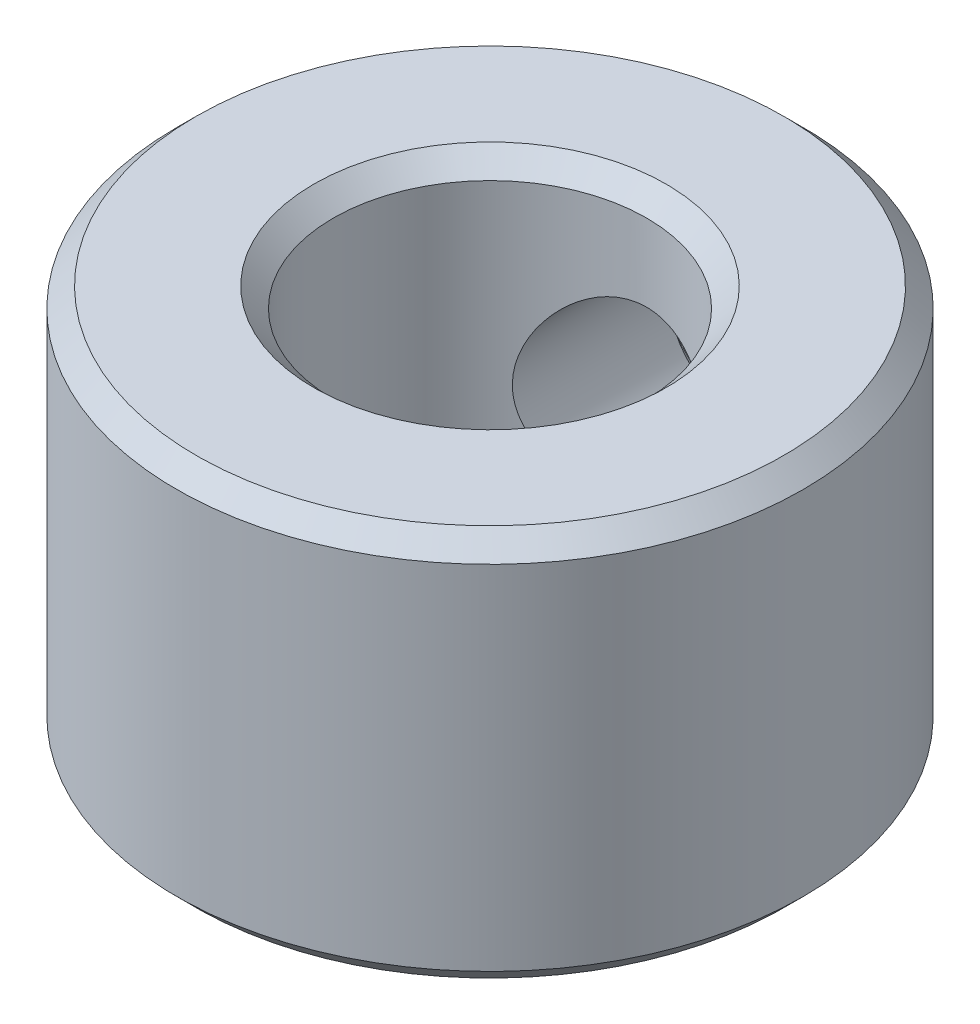
ISO-10303-21;
HEADER;
FILE_DESCRIPTION(('STEP AP214'),'2;1');
FILE_NAME('part.step','',(''),(''),'','','');
FILE_SCHEMA(('AUTOMOTIVE_DESIGN { 1 0 10303 214 1 1 1 1 }'));
ENDSEC;
DATA;
#1=APPLICATION_CONTEXT('core data for automotive mechanical design processes');
#2=APPLICATION_PROTOCOL_DEFINITION('international standard','automotive_design',2000,#1);
#3=PRODUCT_CONTEXT('',#1,'mechanical');
#4=PRODUCT('Part','Part','',(#3));
#5=PRODUCT_RELATED_PRODUCT_CATEGORY('part','',(#4));
#6=PRODUCT_DEFINITION_FORMATION('','',#4);
#7=PRODUCT_DEFINITION_CONTEXT('part definition',#1,'design');
#8=PRODUCT_DEFINITION('design','',#6,#7);
#9=PRODUCT_DEFINITION_SHAPE('','',#8);
#10=(LENGTH_UNIT() NAMED_UNIT(*) SI_UNIT(.MILLI.,.METRE.));
#11=(NAMED_UNIT(*) PLANE_ANGLE_UNIT() SI_UNIT($,.RADIAN.));
#12=(NAMED_UNIT(*) SI_UNIT($,.STERADIAN.) SOLID_ANGLE_UNIT());
#13=UNCERTAINTY_MEASURE_WITH_UNIT(LENGTH_MEASURE(1.E-05),#10,'distance_accuracy_value','');
#14=(GEOMETRIC_REPRESENTATION_CONTEXT(3) GLOBAL_UNCERTAINTY_ASSIGNED_CONTEXT((#13)) GLOBAL_UNIT_ASSIGNED_CONTEXT((#10,
#11,#12)) REPRESENTATION_CONTEXT('',''));
#15=CARTESIAN_POINT('',(0.,0.,0.));
#16=DIRECTION('',(0.,0.,1.));
#17=DIRECTION('',(1.,0.,0.));
#18=AXIS2_PLACEMENT_3D('',#15,#16,#17);
#19=CARTESIAN_POINT('',(0.,4.875,0.));
#20=DIRECTION('',(0.,1.,0.));
#21=DIRECTION('',(1.,0.,0.));
#22=AXIS2_PLACEMENT_3D('',#19,#20,#21);
#23=CONICAL_SURFACE('',#22,2.125,0.785398163397448);
#24=CARTESIAN_POINT('',(0.,5.,0.));
#25=DIRECTION('',(0.,1.,0.));
#26=DIRECTION('',(1.,0.,0.));
#27=AXIS2_PLACEMENT_3D('',#24,#25,#26);
#28=CIRCLE('',#27,2.25);
#29=CARTESIAN_POINT('',(-2.25,5.,0.));
#30=VERTEX_POINT('',#29);
#31=EDGE_CURVE('E204',#30,#30,#28,.T.);
#32=ORIENTED_EDGE('',*,*,#31,.T.);
#33=DIRECTION('',(0.707106781186547,-0.707106781186548,0.));
#34=VECTOR('',#33,1.);
#35=CARTESIAN_POINT('',(-2.125,4.875,0.));
#36=LINE('',#35,#34);
#37=CARTESIAN_POINT('',(-2.,4.75,0.));
#38=VERTEX_POINT('',#37);
#39=EDGE_CURVE('E11',#30,#38,#36,.T.);
#40=ORIENTED_EDGE('',*,*,#39,.T.);
#41=CARTESIAN_POINT('',(0.,4.75,0.));
#42=DIRECTION('',(0.,-1.,0.));
#43=DIRECTION('',(1.,0.,0.));
#44=AXIS2_PLACEMENT_3D('',#41,#42,#43);
#45=CIRCLE('',#44,2.);
#46=EDGE_CURVE('E217',#38,#38,#45,.T.);
#47=ORIENTED_EDGE('',*,*,#46,.T.);
#48=ORIENTED_EDGE('',*,*,#39,.F.);
#49=EDGE_LOOP('',(#32,#40,#47,#48));
#50=FACE_BOUND('',#49,.T.);
#51=ADVANCED_FACE('F17',(#50),#23,.F.);
#52=CARTESIAN_POINT('',(0.,0.,0.));
#53=DIRECTION('',(0.,1.,0.));
#54=DIRECTION('',(1.,0.,0.));
#55=AXIS2_PLACEMENT_3D('',#52,#53,#54);
#56=CYLINDRICAL_SURFACE('',#55,2.);
#57=CARTESIAN_POINT('',(1.2645,2.5,-1.54952888001483));
#58=CARTESIAN_POINT('',(1.26449411796691,2.43735012324644,-1.54953832528692));
#59=CARTESIAN_POINT('',(1.25980123596175,2.37460998732213,-1.55340009895582));
#60=CARTESIAN_POINT('',(1.24137298283824,2.25126618343794,-1.56815840057098));
#61=CARTESIAN_POINT('',(1.22761427551083,2.19066845550868,-1.57907308189968));
#62=CARTESIAN_POINT('',(1.19205271815077,2.07376857766439,-1.60608182446035));
#63=CARTESIAN_POINT('',(1.17032101939601,2.01743359363941,-1.62212991738661));
#64=CARTESIAN_POINT('',(1.11963684574248,1.90928453446939,-1.65751838322308));
#65=CARTESIAN_POINT('',(1.09068388775742,1.85747076209657,-1.67685897636678));
#66=CARTESIAN_POINT('',(1.02173617894958,1.75199397208212,-1.71986123397177));
#67=CARTESIAN_POINT('',(0.980769943374188,1.69905883131843,-1.7437511823403));
#68=CARTESIAN_POINT('',(0.89093919554735,1.6001925381209,-1.79131669705349));
#69=CARTESIAN_POINT('',(0.842067766194926,1.55426758868601,-1.81499205629592));
#70=CARTESIAN_POINT('',(0.730451803901077,1.465052650476,-1.86294646109463));
#71=CARTESIAN_POINT('',(0.666737528883957,1.42280305888443,-1.88693350492434));
#72=CARTESIAN_POINT('',(0.531298337879028,1.34996747456659,-1.92944044111025));
#73=CARTESIAN_POINT('',(0.459581610447951,1.31936969802778,-1.9479658526651));
#74=CARTESIAN_POINT('',(0.318000809823785,1.27412401821854,-1.97573486186531));
#75=CARTESIAN_POINT('',(0.248713007533473,1.25815324205258,-1.98574058327142));
#76=CARTESIAN_POINT('',(0.107801673786748,1.23810190006417,-1.99833990319646));
#77=CARTESIAN_POINT('',(0.0361807627911929,1.23400843009899,-2.00094154584486));
#78=CARTESIAN_POINT('',(-0.0967328525311562,1.23769823411709,-1.99861152687371));
#79=CARTESIAN_POINT('',(-0.158094030613458,1.24392864060202,-1.99466473631825));
#80=CARTESIAN_POINT('',(-0.278694570481386,1.26507623336505,-1.98141571029734));
#81=CARTESIAN_POINT('',(-0.337933771771026,1.27999407525198,-1.97211307064624));
#82=CARTESIAN_POINT('',(-0.452914762909885,1.31784031499373,-1.9489274314289));
#83=CARTESIAN_POINT('',(-0.508651031986307,1.34078100131795,-1.9350374072614));
#84=CARTESIAN_POINT('',(-0.615518921331753,1.39380889945209,-1.90374389911779));
#85=CARTESIAN_POINT('',(-0.66664952948229,1.42389767683448,-1.88633964558184));
#86=CARTESIAN_POINT('',(-0.769757581284988,1.49460510074034,-1.84685964638113));
#87=CARTESIAN_POINT('',(-0.821032566750792,1.53607218519547,-1.82447166495386));
#88=CARTESIAN_POINT('',(-0.916345547494313,1.62616876997324,-1.77851561123726));
#89=CARTESIAN_POINT('',(-0.960372651636247,1.67480884469536,-1.75494583119227));
#90=CARTESIAN_POINT('',(-1.04598643244538,1.78556668533021,-1.70548199944205));
#91=CARTESIAN_POINT('',(-1.08644277160218,1.84861743719009,-1.67970330352267));
#92=CARTESIAN_POINT('',(-1.15604990573414,1.98216587136297,-1.63258088815751));
#93=CARTESIAN_POINT('',(-1.1852213789095,2.05264962893361,-1.61122909058669));
#94=CARTESIAN_POINT('',(-1.2246161450688,2.17992201583035,-1.58137778507439));
#95=CARTESIAN_POINT('',(-1.23781972955308,2.23533731102721,-1.57096854929203));
#96=CARTESIAN_POINT('',(-1.2566505024441,2.34817824878922,-1.55594978135884));
#97=CARTESIAN_POINT('',(-1.26228851443341,2.40560089853876,-1.55133196441425));
#98=CARTESIAN_POINT('',(-1.26564578829317,2.52098806068944,-1.54859515876369));
#99=CARTESIAN_POINT('',(-1.26334448419211,2.57895359188928,-1.55049304825479));
#100=CARTESIAN_POINT('',(-1.25093577610471,2.69350884817042,-1.56051880729487));
#101=CARTESIAN_POINT('',(-1.24082186157763,2.75009738516122,-1.56865187280686));
#102=CARTESIAN_POINT('',(-1.21366943674918,2.85925861904806,-1.58974532293077));
#103=CARTESIAN_POINT('',(-1.1967843787254,2.91189147657731,-1.60259823220519));
#104=CARTESIAN_POINT('',(-1.15675412768388,3.01368807254575,-1.63172650488258));
#105=CARTESIAN_POINT('',(-1.1336067386191,3.06285058637963,-1.64800306843138));
#106=CARTESIAN_POINT('',(-1.07658218628269,3.16638258759106,-1.68592855061878));
#107=CARTESIAN_POINT('',(-1.04149675234294,3.21992850889003,-1.70800822887954));
#108=CARTESIAN_POINT('',(-0.963864401793085,3.32096981729384,-1.75299258821368));
#109=CARTESIAN_POINT('',(-0.921309629627182,3.36845874251176,-1.77589811748598));
#110=CARTESIAN_POINT('',(-0.821420704703212,3.46425733392833,-1.82451368153187));
#111=CARTESIAN_POINT('',(-0.762803985042327,3.51133859050659,-1.8500399732252));
#112=CARTESIAN_POINT('',(-0.636990044557513,3.59494194218451,-1.8970357779525));
#113=CARTESIAN_POINT('',(-0.569796236109793,3.6314682178001,-1.91850689595041));
#114=CARTESIAN_POINT('',(-0.432254308912909,3.69054688083504,-1.95394855830421));
#115=CARTESIAN_POINT('',(-0.362282006019539,3.7137564589949,-1.96826622926783));
#116=CARTESIAN_POINT('',(-0.218314556068939,3.74769609803434,-1.98937292908515));
#117=CARTESIAN_POINT('',(-0.144325456886686,3.75844440401708,-1.99617296416441));
#118=CARTESIAN_POINT('',(-0.00665707801373274,3.76606929450586,-2.00099185098277));
#119=CARTESIAN_POINT('',(0.0568858046173655,3.76480085080471,-2.0001850416096));
#120=CARTESIAN_POINT('',(0.182709540069951,3.75282403612561,-1.99263276935113));
#121=CARTESIAN_POINT('',(0.244990477096484,3.74211629713365,-1.98588770404796));
#122=CARTESIAN_POINT('',(0.364008255181647,3.712464633797,-1.96748125913666));
#123=CARTESIAN_POINT('',(0.420867567149991,3.6938735435709,-1.95603107711261));
#124=CARTESIAN_POINT('',(0.530593796569564,3.64932134254513,-1.92916148883134));
#125=CARTESIAN_POINT('',(0.58346008343398,3.62335907074123,-1.91374145733531));
#126=CARTESIAN_POINT('',(0.68954176175382,3.56189672046674,-1.8782890840866));
#127=CARTESIAN_POINT('',(0.742245311387839,3.52569494478695,-1.85794707932388));
#128=CARTESIAN_POINT('',(0.841195569530736,3.44624724224734,-1.81529603663499));
#129=CARTESIAN_POINT('',(0.887435048339554,3.40299354345176,-1.79298484104648));
#130=CARTESIAN_POINT('',(0.979270491623404,3.3032714453577,-1.7447348464483));
#131=CARTESIAN_POINT('',(1.02375166101236,3.24579451602162,-1.71874926626124));
#132=CARTESIAN_POINT('',(1.10261752614741,3.12329097722003,-1.66925222113531));
#133=CARTESIAN_POINT('',(1.1370067814702,3.05826779577634,-1.64573964197263));
#134=CARTESIAN_POINT('',(1.18818249135166,2.93651580305712,-1.60903404622307));
#135=CARTESIAN_POINT('',(1.20717019521899,2.88105495048418,-1.59470883609959));
#136=CARTESIAN_POINT('',(1.23737203476855,2.76706109813201,-1.57139495785571));
#137=CARTESIAN_POINT('',(1.24861010049216,2.70853816143648,-1.56238987421431));
#138=CARTESIAN_POINT('',(1.25859624043419,2.62456942414068,-1.55433160058593));
#139=CARTESIAN_POINT('',(1.26080597808091,2.59974838666082,-1.55253745914827));
#140=CARTESIAN_POINT('',(1.26375922886068,2.54995637712227,-1.5501340553494));
#141=CARTESIAN_POINT('',(1.26450234581071,2.52498536637754,-1.54952511315053));
#142=CARTESIAN_POINT('',(1.2645,2.5,-1.54952888001483));
#143=B_SPLINE_CURVE_WITH_KNOTS('',3,(#57,#58,#59,#60,#61,#62,#63,#64,#65,#66,#67,#68,#69,#70,
#71,#72,#73,#74,#75,#76,#77,#78,#79,#80,#81,#82,#83,#84,#85,#86,#87,#88,#89,#90,#91,#92,#93,#94,
#95,#96,#97,#98,#99,#100,#101,#102,#103,#104,#105,#106,#107,#108,#109,#110,#111,#112,#113,#114,
#115,#116,#117,#118,#119,#120,#121,#122,#123,#124,#125,#126,#127,#128,#129,#130,#131,#132,#133,
#134,#135,#136,#137,#138,#139,#140,#141,#142),.UNSPECIFIED.,.T.,.F.,(4,2,2,2,2,2,2,2,2,2,2,2,2,
2,2,2,2,2,2,2,2,2,2,2,2,2,2,2,2,2,2,2,2,2,2,2,2,2,2,2,2,2,4),(0.,0.187834998618613,
0.376155399361165,0.562834551812605,0.74952619603823,0.96192621140118,1.17451309377345,
1.41357454197133,1.65239357434149,1.86649900785851,2.08037173848349,2.26489251750059,
2.44942722342765,2.63424582532583,2.81910494351061,3.02721650045857,3.23563797985774,
3.47217432561049,3.70827516954924,3.88128567913113,4.05404840877014,4.2272589979291,
4.40061408588117,4.57024443479238,4.73993434621561,4.94234058954809,5.14496099459186,
5.38196739397222,5.618879793056,5.84278297062728,6.06635790592645,6.25605905235322,
6.44574749874689,6.62771803900912,6.80971725661148,7.01023551077349,7.21097626913794,
7.44152072744398,7.67196086369056,7.85232662520503,8.03213291238308,8.10702306777426,
8.18193345071839),.UNSPECIFIED.);
#144=CARTESIAN_POINT('',(-1.2645,2.5,-1.54952888001483));
#145=VERTEX_POINT('',#144);
#146=EDGE_CURVE('E95',#145,#145,#143,.T.);
#147=ORIENTED_EDGE('',*,*,#146,.T.);
#148=EDGE_LOOP('',(#147));
#149=FACE_BOUND('',#148,.T.);
#150=ORIENTED_EDGE('',*,*,#46,.F.);
#151=DIRECTION('',(0.,-1.,0.));
#152=VECTOR('',#151,1.);
#153=CARTESIAN_POINT('',(-2.,0.,0.));
#154=LINE('',#153,#152);
#155=CARTESIAN_POINT('',(-2.,0.25,0.));
#156=VERTEX_POINT('',#155);
#157=EDGE_CURVE('E27',#38,#156,#154,.T.);
#158=ORIENTED_EDGE('',*,*,#157,.T.);
#159=CARTESIAN_POINT('',(0.,0.25,0.));
#160=DIRECTION('',(0.,1.,0.));
#161=DIRECTION('',(1.,0.,0.));
#162=AXIS2_PLACEMENT_3D('',#159,#160,#161);
#163=CIRCLE('',#162,2.);
#164=EDGE_CURVE('E213',#156,#156,#163,.T.);
#165=ORIENTED_EDGE('',*,*,#164,.F.);
#166=ORIENTED_EDGE('',*,*,#157,.F.);
#167=EDGE_LOOP('',(#150,#158,#165,#166));
#168=FACE_BOUND('',#167,.T.);
#169=ADVANCED_FACE('F162',(#149,#168),#56,.F.);
#170=CARTESIAN_POINT('',(0.,0.125,0.));
#171=DIRECTION('',(0.,-1.,0.));
#172=DIRECTION('',(1.,0.,0.));
#173=AXIS2_PLACEMENT_3D('',#170,#171,#172);
#174=CONICAL_SURFACE('',#173,2.125,0.785398163397448);
#175=ORIENTED_EDGE('',*,*,#164,.T.);
#176=DIRECTION('',(-0.707106781186547,-0.707106781186548,0.));
#177=VECTOR('',#176,1.);
#178=CARTESIAN_POINT('',(-2.125,0.125,0.));
#179=LINE('',#178,#177);
#180=CARTESIAN_POINT('',(-2.25,0.,0.));
#181=VERTEX_POINT('',#180);
#182=EDGE_CURVE('E214',#156,#181,#179,.T.);
#183=ORIENTED_EDGE('',*,*,#182,.T.);
#184=CARTESIAN_POINT('',(0.,0.,0.));
#185=DIRECTION('',(0.,-1.,0.));
#186=DIRECTION('',(1.,0.,0.));
#187=AXIS2_PLACEMENT_3D('',#184,#185,#186);
#188=CIRCLE('',#187,2.25);
#189=EDGE_CURVE('E198',#181,#181,#188,.T.);
#190=ORIENTED_EDGE('',*,*,#189,.T.);
#191=ORIENTED_EDGE('',*,*,#182,.F.);
#192=EDGE_LOOP('',(#175,#183,#190,#191));
#193=FACE_BOUND('',#192,.T.);
#194=ADVANCED_FACE('F19',(#193),#174,.F.);
#195=CARTESIAN_POINT('',(0.,5.,0.));
#196=DIRECTION('',(0.,1.,0.));
#197=DIRECTION('',(1.,0.,0.));
#198=AXIS2_PLACEMENT_3D('',#195,#196,#197);
#199=PLANE('',#198);
#200=ORIENTED_EDGE('',*,*,#31,.F.);
#201=EDGE_LOOP('',(#200));
#202=FACE_BOUND('',#201,.T.);
#203=CARTESIAN_POINT('',(0.,5.,0.));
#204=DIRECTION('',(0.,-1.,0.));
#205=DIRECTION('',(1.,0.,0.));
#206=AXIS2_PLACEMENT_3D('',#203,#204,#205);
#207=CIRCLE('',#206,3.75);
#208=CARTESIAN_POINT('',(-3.75,5.,0.));
#209=VERTEX_POINT('',#208);
#210=EDGE_CURVE('E193',#209,#209,#207,.T.);
#211=ORIENTED_EDGE('',*,*,#210,.F.);
#212=EDGE_LOOP('',(#211));
#213=FACE_BOUND('',#212,.T.);
#214=ADVANCED_FACE('F177',(#202,#213),#199,.T.);
#215=CARTESIAN_POINT('',(0.,4.875,0.));
#216=DIRECTION('',(0.,-1.,0.));
#217=DIRECTION('',(1.,0.,0.));
#218=AXIS2_PLACEMENT_3D('',#215,#216,#217);
#219=CONICAL_SURFACE('',#218,3.875,0.785398163397448);
#220=ORIENTED_EDGE('',*,*,#210,.T.);
#221=DIRECTION('',(-0.707106781186548,-0.707106781186548,0.));
#222=VECTOR('',#221,1.);
#223=CARTESIAN_POINT('',(-3.875,4.875,0.));
#224=LINE('',#223,#222);
#225=CARTESIAN_POINT('',(-4.,4.75,0.));
#226=VERTEX_POINT('',#225);
#227=EDGE_CURVE('E194',#209,#226,#224,.T.);
#228=ORIENTED_EDGE('',*,*,#227,.T.);
#229=CARTESIAN_POINT('',(0.,4.75,0.));
#230=DIRECTION('',(0.,1.,0.));
#231=DIRECTION('',(1.,0.,0.));
#232=AXIS2_PLACEMENT_3D('',#229,#230,#231);
#233=CIRCLE('',#232,4.);
#234=EDGE_CURVE('E148',#226,#226,#233,.T.);
#235=ORIENTED_EDGE('',*,*,#234,.T.);
#236=ORIENTED_EDGE('',*,*,#227,.F.);
#237=EDGE_LOOP('',(#220,#228,#235,#236));
#238=FACE_BOUND('',#237,.T.);
#239=ADVANCED_FACE('F180',(#238),#219,.T.);
#240=CARTESIAN_POINT('',(0.,0.,0.));
#241=DIRECTION('',(0.,1.,0.));
#242=DIRECTION('',(1.,0.,0.));
#243=AXIS2_PLACEMENT_3D('',#240,#241,#242);
#244=PLANE('',#243);
#245=ORIENTED_EDGE('',*,*,#189,.F.);
#246=EDGE_LOOP('',(#245));
#247=FACE_BOUND('',#246,.T.);
#248=CARTESIAN_POINT('',(0.,0.,0.));
#249=DIRECTION('',(0.,1.,0.));
#250=DIRECTION('',(1.,0.,0.));
#251=AXIS2_PLACEMENT_3D('',#248,#249,#250);
#252=CIRCLE('',#251,3.75);
#253=CARTESIAN_POINT('',(-3.75,0.,0.));
#254=VERTEX_POINT('',#253);
#255=EDGE_CURVE('E207',#254,#254,#252,.T.);
#256=ORIENTED_EDGE('',*,*,#255,.F.);
#257=EDGE_LOOP('',(#256));
#258=FACE_BOUND('',#257,.T.);
#259=ADVANCED_FACE('F182',(#247,#258),#244,.F.);
#260=CARTESIAN_POINT('',(0.,0.125,0.));
#261=DIRECTION('',(0.,1.,0.));
#262=DIRECTION('',(1.,0.,0.));
#263=AXIS2_PLACEMENT_3D('',#260,#261,#262);
#264=CONICAL_SURFACE('',#263,3.875,0.785398163397449);
#265=CARTESIAN_POINT('',(0.,0.25,0.));
#266=DIRECTION('',(0.,-1.,0.));
#267=DIRECTION('',(1.,0.,0.));
#268=AXIS2_PLACEMENT_3D('',#265,#266,#267);
#269=CIRCLE('',#268,4.);
#270=CARTESIAN_POINT('',(-4.,0.25,0.));
#271=VERTEX_POINT('',#270);
#272=EDGE_CURVE('E265',#271,#271,#269,.T.);
#273=ORIENTED_EDGE('',*,*,#272,.T.);
#274=DIRECTION('',(0.707106781186548,-0.707106781186547,0.));
#275=VECTOR('',#274,1.);
#276=CARTESIAN_POINT('',(-3.875,0.125,0.));
#277=LINE('',#276,#275);
#278=EDGE_CURVE('E254',#271,#254,#277,.T.);
#279=ORIENTED_EDGE('',*,*,#278,.T.);
#280=ORIENTED_EDGE('',*,*,#255,.T.);
#281=ORIENTED_EDGE('',*,*,#278,.F.);
#282=EDGE_LOOP('',(#273,#279,#280,#281));
#283=FACE_BOUND('',#282,.T.);
#284=ADVANCED_FACE('F169',(#283),#264,.T.);
#285=CARTESIAN_POINT('',(0.,0.,0.));
#286=DIRECTION('',(0.,1.,0.));
#287=DIRECTION('',(1.,0.,0.));
#288=AXIS2_PLACEMENT_3D('',#285,#286,#287);
#289=CYLINDRICAL_SURFACE('',#288,4.);
#290=CARTESIAN_POINT('',(-1.49909382170273,2.5,-3.70846568188599));
#291=CARTESIAN_POINT('',(-1.49909382170273,2.72089732128893,-3.70846568188599));
#292=CARTESIAN_POINT('',(-1.38922205118641,3.19635642810341,-3.75235090255221));
#293=CARTESIAN_POINT('',(-0.83670897618908,3.89780784607125,-3.94334263837228));
#294=CARTESIAN_POINT('',(0.134475216136004,4.14246029251629,-4.05059755334012));
#295=CARTESIAN_POINT('',(0.877762587617222,3.76473716202204,-3.90863752858632));
#296=CARTESIAN_POINT('',(1.17855956450457,3.46068884661615,-3.82497921274844));
#297=CARTESIAN_POINT('',(1.42325993677328,3.06780020018476,-3.74155425360215));
#298=CARTESIAN_POINT('',(1.54874891459138,2.5047164954535,-3.68554379966131));
#299=CARTESIAN_POINT('',(1.34579703618987,1.58050804657097,-3.77692919929063));
#300=CARTESIAN_POINT('',(0.58671246259579,0.976733181262446,-4.00522023908345));
#301=CARTESIAN_POINT('',(-0.344933753518193,0.971338670866824,-4.00467209967727));
#302=CARTESIAN_POINT('',(-0.980947661805724,1.28301447876608,-3.8915658372877));
#303=CARTESIAN_POINT('',(-1.38467666273256,1.80064474179365,-3.75513782088051));
#304=CARTESIAN_POINT('',(-1.49909382170273,2.27910267871108,-3.70846568188599));
#305=CARTESIAN_POINT('',(-1.49909382170273,2.5,-3.70846568188599));
#306=(BOUNDED_CURVE() B_SPLINE_CURVE(3,(#290,#291,#292,#293,#294,#295,#296,#297,#298,#299,#300,
#301,#302,#303,#304,#305),.UNSPECIFIED.,.T.,.F.) B_SPLINE_CURVE_WITH_KNOTS((4,1,1,1,1,1,1,1,1,1,
1,1,1,4),(0.,0.0548453600584061,0.109690720116813,0.219381440233627,0.274226800292034,
0.301649480321237,0.329072160350441,0.383917520408847,0.438762880467254,0.548453600584068,
0.603298960642475,0.658144320700881,0.712989680759288,0.767835040817695),
.UNSPECIFIED.) CURVE() GEOMETRIC_REPRESENTATION_ITEM() RATIONAL_B_SPLINE_CURVE((1.,1.,1.,1.,1.,
1.,1.,1.,1.,1.,1.,1.,1.,1.,1.,1.)) REPRESENTATION_ITEM(''));
#307=CARTESIAN_POINT('',(-1.49909382170353,2.5,-3.70846568188655));
#308=VERTEX_POINT('',#307);
#309=EDGE_CURVE('E87',#308,#308,#306,.T.);
#310=ORIENTED_EDGE('',*,*,#309,.F.);
#311=EDGE_LOOP('',(#310));
#312=FACE_BOUND('',#311,.T.);
#313=ORIENTED_EDGE('',*,*,#234,.F.);
#314=DIRECTION('',(0.,-1.,0.));
#315=VECTOR('',#314,1.);
#316=CARTESIAN_POINT('',(-4.,0.,0.));
#317=LINE('',#316,#315);
#318=EDGE_CURVE('E156',#226,#271,#317,.T.);
#319=ORIENTED_EDGE('',*,*,#318,.T.);
#320=ORIENTED_EDGE('',*,*,#272,.F.);
#321=ORIENTED_EDGE('',*,*,#318,.F.);
#322=EDGE_LOOP('',(#313,#319,#320,#321));
#323=FACE_BOUND('',#322,.T.);
#324=ADVANCED_FACE('F164',(#312,#323),#289,.T.);
#325=CARTESIAN_POINT('',(0.,2.5,0.));
#326=DIRECTION('',(0.,0.,-1.));
#327=DIRECTION('',(1.,0.,0.));
#328=AXIS2_PLACEMENT_3D('',#325,#326,#327);
#329=CYLINDRICAL_SURFACE('',#328,1.2645);
#330=ORIENTED_EDGE('',*,*,#146,.F.);
#331=DIRECTION('',(0.,0.,-1.));
#332=VECTOR('',#331,1.);
#333=CARTESIAN_POINT('',(-1.2645,2.5,0.));
#334=LINE('',#333,#332);
#335=CARTESIAN_POINT('',(-1.2645,2.5,-3.54487018882069));
#336=VERTEX_POINT('',#335);
#337=EDGE_CURVE('E141',#145,#336,#334,.T.);
#338=ORIENTED_EDGE('',*,*,#337,.T.);
#339=CARTESIAN_POINT('',(-1.2645,2.5,-3.54487018882069));
#340=CARTESIAN_POINT('',(-1.2645,2.30513838343412,-3.54487018882069));
#341=CARTESIAN_POINT('',(-1.15345052099916,1.88446936891256,-3.57970347471206));
#342=CARTESIAN_POINT('',(-0.786408014453958,1.45704909304605,-3.67834808926274));
#343=CARTESIAN_POINT('',(-0.265009806986551,1.2252731657563,-3.75286596992555));
#344=CARTESIAN_POINT('',(0.447537665195123,1.22598802030911,-3.75513969316828));
#345=CARTESIAN_POINT('',(1.11012956348669,1.68773755547493,-3.5972577942593));
#346=CARTESIAN_POINT('',(1.31564721330752,2.50481059416571,-3.52710582475938));
#347=CARTESIAN_POINT('',(1.18951754981533,3.00031332352077,-3.56982230561473));
#348=CARTESIAN_POINT('',(0.966644388217517,3.33074133040212,-3.62998545166653));
#349=CARTESIAN_POINT('',(0.700913744542567,3.57814661811471,-3.68941528329172));
#350=CARTESIAN_POINT('',(0.0977762955579307,3.85760231497487,-3.78324886983267));
#351=CARTESIAN_POINT('',(-0.650957008547244,3.68817240149751,-3.71447903576025));
#352=CARTESIAN_POINT('',(-1.15935930369818,3.11493574902256,-3.57827749934624));
#353=CARTESIAN_POINT('',(-1.2645,2.69486161656589,-3.54487018882069));
#354=CARTESIAN_POINT('',(-1.2645,2.5,-3.54487018882069));
#355=(BOUNDED_CURVE() B_SPLINE_CURVE(3,(#339,#340,#341,#342,#343,#344,#345,#346,#347,#348,#349,
#350,#351,#352,#353,#354),.UNSPECIFIED.,.T.,.F.) B_SPLINE_CURVE_WITH_KNOTS((4,1,1,1,1,1,1,1,1,1,
1,1,1,4),(0.,0.0548453600584068,0.109690720116814,0.16453608017522,0.219381440233627,
0.329072160350441,0.383917520408848,0.438762880467254,0.466185560496458,0.493608240525661,
0.548453600584068,0.658144320700882,0.712989680759289,0.767835040817695),
.UNSPECIFIED.) CURVE() GEOMETRIC_REPRESENTATION_ITEM() RATIONAL_B_SPLINE_CURVE((1.,1.,1.,1.,1.,
1.,1.,1.,1.,1.,1.,1.,1.,1.,1.,1.)) REPRESENTATION_ITEM(''));
#356=EDGE_CURVE('E96',#336,#336,#355,.T.);
#357=ORIENTED_EDGE('',*,*,#356,.F.);
#358=ORIENTED_EDGE('',*,*,#337,.F.);
#359=EDGE_LOOP('',(#330,#338,#357,#358));
#360=FACE_BOUND('',#359,.T.);
#361=ADVANCED_FACE('F116',(#360),#329,.F.);
#362=CARTESIAN_POINT('',(-1.49909382170353,2.5,-3.70846568188655));
#363=CARTESIAN_POINT('',(-1.49909382170353,2.27910267871099,-3.70846568188655));
#364=CARTESIAN_POINT('',(-1.38467666273335,1.80064474179336,-3.75513782088111));
#365=CARTESIAN_POINT('',(-0.980947661806387,1.28301447876549,-3.89156583728843));
#366=CARTESIAN_POINT('',(-0.344933753518465,0.971338670865958,-4.00467209967813));
#367=CARTESIAN_POINT('',(0.586712462596265,0.976733181261597,-4.0052202390843));
#368=CARTESIAN_POINT('',(1.34579703619067,1.5805080465706,-3.77692919929124));
#369=CARTESIAN_POINT('',(1.54874891459217,2.5047164954535,-3.68554379966185));
#370=CARTESIAN_POINT('',(1.42325993677408,3.06780020018499,-3.74155425360274));
#371=CARTESIAN_POINT('',(1.17855956450529,3.46068884661659,-3.8249792127491));
#372=CARTESIAN_POINT('',(0.877762587617825,3.76473716202268,-3.90863752858707));
#373=CARTESIAN_POINT('',(0.134475216136129,4.14246029251726,-4.05059755334103));
#374=CARTESIAN_POINT('',(-0.836708976189713,3.89780784607197,-3.94334263837306));
#375=CARTESIAN_POINT('',(-1.38922205118719,3.19635642810369,-3.7523509025528));
#376=CARTESIAN_POINT('',(-1.49909382170353,2.72089732128902,-3.70846568188655));
#377=CARTESIAN_POINT('',(-1.49909382170353,2.5,-3.70846568188655));
#378=CARTESIAN_POINT('',(-1.42089588113569,2.5,-3.6539338508646));
#379=CARTESIAN_POINT('',(-1.42089588113569,2.28778124695203,-3.6539338508646));
#380=CARTESIAN_POINT('',(-1.30760128215528,1.82858628416643,-3.69665970549143));
#381=CARTESIAN_POINT('',(-0.91610111268891,1.34102601685901,-3.8204932546132));
#382=CARTESIAN_POINT('',(-0.318292438007827,1.05598350249607,-3.92073672309394));
#383=CARTESIAN_POINT('',(0.540320863462551,1.05981812761077,-3.92186005711229));
#384=CARTESIAN_POINT('',(1.26724121195601,1.61625121620538,-3.71703873094726));
#385=CARTESIAN_POINT('',(1.47104834749729,2.5047478616909,-3.63273114136103));
#386=CARTESIAN_POINT('',(1.34534580778783,3.04530457463024,-3.68431027094007));
#387=CARTESIAN_POINT('',(1.10792117240936,3.41737300787843,-3.75998129238824));
#388=CARTESIAN_POINT('',(0.818812973259405,3.70254031405335,-3.83556344682196));
#389=CARTESIAN_POINT('',(0.122242242610064,4.04750763333646,-3.96148132550491));
#390=CARTESIAN_POINT('',(-0.774791653642223,3.82792936454715,-3.86705477083546));
#391=CARTESIAN_POINT('',(-1.31260113535752,3.16921620174331,-3.69432643481728));
#392=CARTESIAN_POINT('',(-1.42089588113569,2.71221875304797,-3.6539338508646));
#393=CARTESIAN_POINT('',(-1.42089588113569,2.5,-3.6539338508646));
#394=CARTESIAN_POINT('',(-1.34269794056784,2.5,-3.59940201984265));
#395=CARTESIAN_POINT('',(-1.34269794056784,2.29645981519307,-3.59940201984265));
#396=CARTESIAN_POINT('',(-1.23052590157722,1.85652782653949,-3.63818159010174));
#397=CARTESIAN_POINT('',(-0.851254563571434,1.39903755495253,-3.74942067193797));
#398=CARTESIAN_POINT('',(-0.291651122497189,1.14062833412619,-3.83680134650975));
#399=CARTESIAN_POINT('',(0.493929264328837,1.14290307395994,-3.83849987514029));
#400=CARTESIAN_POINT('',(1.18868538772135,1.65199438584016,-3.65714826260328));
#401=CARTESIAN_POINT('',(1.39334778040241,2.50477922792831,-3.5799184830602));
#402=CARTESIAN_POINT('',(1.26743167880158,3.02280894907551,-3.6270662882774));
#403=CARTESIAN_POINT('',(1.03728278031344,3.37405716914028,-3.69498337202739));
#404=CARTESIAN_POINT('',(0.759863358900986,3.64034346608403,-3.76248936505684));
#405=CARTESIAN_POINT('',(0.110009269083997,3.95255497415567,-3.87236509766879));
#406=CARTESIAN_POINT('',(-0.712874331094734,3.75805088302233,-3.79076690329786));
#407=CARTESIAN_POINT('',(-1.23598021952785,3.14207597538294,-3.63630196708176));
#408=CARTESIAN_POINT('',(-1.34269794056784,2.70354018480693,-3.59940201984265));
#409=CARTESIAN_POINT('',(-1.34269794056784,2.5,-3.59940201984265));
#410=CARTESIAN_POINT('',(-1.2645,2.5,-3.54487018882069));
#411=CARTESIAN_POINT('',(-1.2645,2.30513838343412,-3.54487018882069));
#412=CARTESIAN_POINT('',(-1.15345052099916,1.88446936891256,-3.57970347471206));
#413=CARTESIAN_POINT('',(-0.786408014453958,1.45704909304605,-3.67834808926274));
#414=CARTESIAN_POINT('',(-0.265009806986551,1.2252731657563,-3.75286596992555));
#415=CARTESIAN_POINT('',(0.447537665195123,1.22598802030911,-3.75513969316828));
#416=CARTESIAN_POINT('',(1.11012956348669,1.68773755547493,-3.5972577942593));
#417=CARTESIAN_POINT('',(1.31564721330752,2.50481059416571,-3.52710582475938));
#418=CARTESIAN_POINT('',(1.18951754981533,3.00031332352077,-3.56982230561473));
#419=CARTESIAN_POINT('',(0.966644388217517,3.33074133040212,-3.62998545166653));
#420=CARTESIAN_POINT('',(0.700913744542567,3.57814661811471,-3.68941528329172));
#421=CARTESIAN_POINT('',(0.0977762955579307,3.85760231497487,-3.78324886983267));
#422=CARTESIAN_POINT('',(-0.650957008547244,3.68817240149751,-3.71447903576025));
#423=CARTESIAN_POINT('',(-1.15935930369818,3.11493574902256,-3.57827749934624));
#424=CARTESIAN_POINT('',(-1.2645,2.69486161656589,-3.54487018882069));
#425=CARTESIAN_POINT('',(-1.2645,2.5,-3.54487018882069));
#426=(BOUNDED_SURFACE() B_SPLINE_SURFACE(3,3,((#362,#363,#364,#365,#366,#367,#368,#369,#370,
#371,#372,#373,#374,#375,#376,#377),(#378,#379,#380,#381,#382,#383,#384,#385,#386,#387,#388,
#389,#390,#391,#392,#393),(#394,#395,#396,#397,#398,#399,#400,#401,#402,#403,#404,#405,#406,
#407,#408,#409),(#410,#411,#412,#413,#414,#415,#416,#417,#418,#419,#420,#421,#422,#423,#424,
#425)),.UNSPECIFIED.,.F.,.T.,.F.) B_SPLINE_SURFACE_WITH_KNOTS((4,4),(4,1,1,1,1,1,1,1,1,1,1,1,1,
4),(0.,1.),(0.,0.0548453600584068,0.109690720116814,0.16453608017522,0.219381440233627,
0.329072160350441,0.383917520408848,0.438762880467254,0.466185560496458,0.493608240525661,
0.548453600584068,0.658144320700882,0.712989680759289,0.767835040817695),
.UNSPECIFIED.) GEOMETRIC_REPRESENTATION_ITEM() RATIONAL_B_SPLINE_SURFACE(((1.,1.,1.,1.,1.,1.,1.,
1.,1.,1.,1.,1.,1.,1.,1.,1.),(1.,1.,1.,1.,1.,1.,1.,1.,1.,1.,1.,1.,1.,1.,1.,1.),(1.,1.,1.,1.,1.,
1.,1.,1.,1.,1.,1.,1.,1.,1.,1.,1.),(1.,1.,1.,1.,1.,1.,1.,1.,1.,1.,1.,1.,1.,1.,1.,1.))) REPRESENTATION_ITEM('') SURFACE());
#427=DIRECTION('',(0.820249360785047,0.,0.5720061067259));
#428=VECTOR('',#427,1.);
#429=CARTESIAN_POINT('',(-1.49909382170353,2.5,-3.70846568188655));
#430=LINE('',#429,#428);
#431=EDGE_CURVE('E91',#308,#336,#430,.T.);
#432=ORIENTED_EDGE('',*,*,#431,.T.);
#433=ORIENTED_EDGE('',*,*,#356,.T.);
#434=ORIENTED_EDGE('',*,*,#431,.F.);
#435=ORIENTED_EDGE('',*,*,#309,.T.);
#436=EDGE_LOOP('',(#432,#433,#434,#435));
#437=FACE_BOUND('',#436,.T.);
#438=ADVANCED_FACE('F89',(#437),#426,.T.);
#439=CLOSED_SHELL('',(#51,#169,#194,#214,#239,#259,#284,#324,#361,#438));
#440=MANIFOLD_SOLID_BREP('B1',#439);
#441=ADVANCED_BREP_SHAPE_REPRESENTATION('',(#18,#440),#14);
#442=SHAPE_DEFINITION_REPRESENTATION(#9,#441);
ENDSEC;
END-ISO-10303-21;
